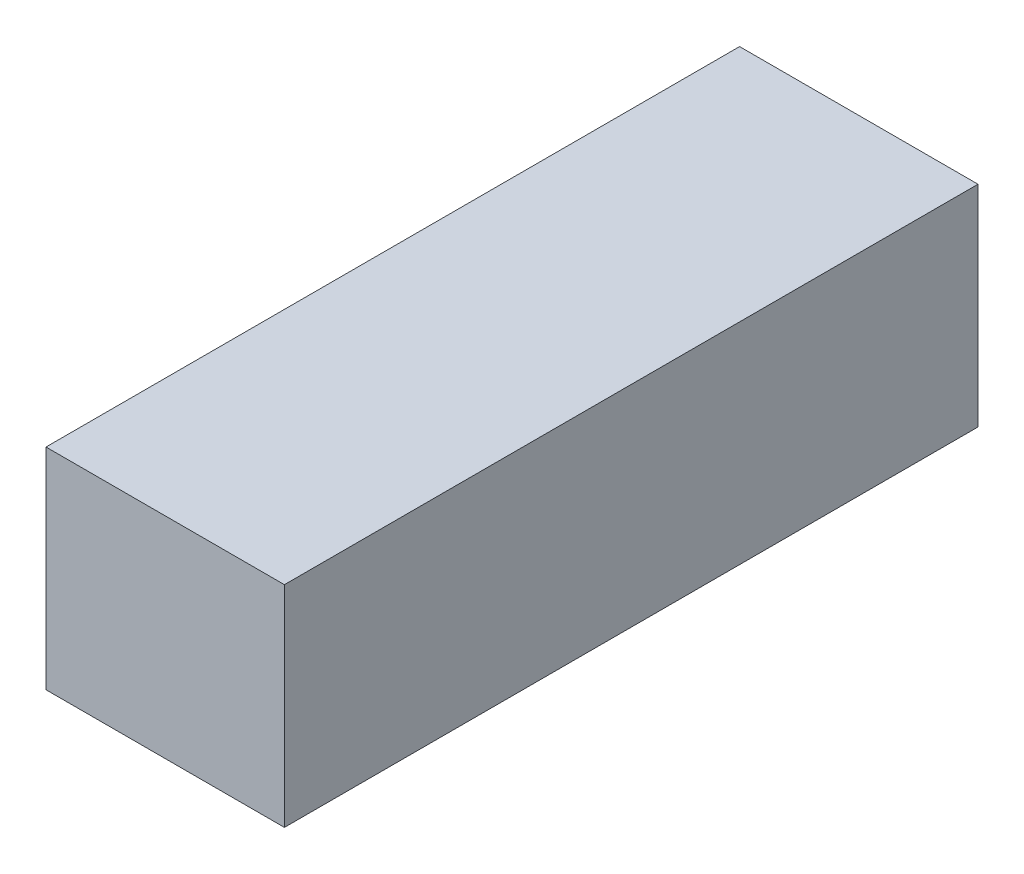
ISO-10303-21;
HEADER;
FILE_DESCRIPTION(('STEP AP214'),'2;1');
FILE_NAME('part.step','',(''),(''),'','','');
FILE_SCHEMA(('AUTOMOTIVE_DESIGN { 1 0 10303 214 1 1 1 1 }'));
ENDSEC;
DATA;
#1=APPLICATION_CONTEXT('core data for automotive mechanical design processes');
#2=APPLICATION_PROTOCOL_DEFINITION('international standard','automotive_design',2000,#1);
#3=PRODUCT_CONTEXT('',#1,'mechanical');
#4=PRODUCT('Part','Part','',(#3));
#5=PRODUCT_RELATED_PRODUCT_CATEGORY('part','',(#4));
#6=PRODUCT_DEFINITION_FORMATION('','',#4);
#7=PRODUCT_DEFINITION_CONTEXT('part definition',#1,'design');
#8=PRODUCT_DEFINITION('design','',#6,#7);
#9=PRODUCT_DEFINITION_SHAPE('','',#8);
#10=(LENGTH_UNIT() NAMED_UNIT(*) SI_UNIT(.MILLI.,.METRE.));
#11=(NAMED_UNIT(*) PLANE_ANGLE_UNIT() SI_UNIT($,.RADIAN.));
#12=(NAMED_UNIT(*) SI_UNIT($,.STERADIAN.) SOLID_ANGLE_UNIT());
#13=UNCERTAINTY_MEASURE_WITH_UNIT(LENGTH_MEASURE(1.E-05),#10,'distance_accuracy_value','');
#14=(GEOMETRIC_REPRESENTATION_CONTEXT(3) GLOBAL_UNCERTAINTY_ASSIGNED_CONTEXT((#13)) GLOBAL_UNIT_ASSIGNED_CONTEXT((#10,
#11,#12)) REPRESENTATION_CONTEXT('',''));
#15=CARTESIAN_POINT('',(0.,0.,0.));
#16=DIRECTION('',(0.,0.,1.));
#17=DIRECTION('',(1.,0.,0.));
#18=AXIS2_PLACEMENT_3D('',#15,#16,#17);
#19=CARTESIAN_POINT('',(0.,0.,160.));
#20=DIRECTION('',(0.,1.,0.));
#21=DIRECTION('',(-1.,0.,0.));
#22=AXIS2_PLACEMENT_3D('',#19,#20,#21);
#23=PLANE('',#22);
#24=DIRECTION('',(1.,0.,0.));
#25=VECTOR('',#24,1.);
#26=CARTESIAN_POINT('',(0.,0.,0.));
#27=LINE('',#26,#25);
#28=CARTESIAN_POINT('',(-55.,0.,0.));
#29=VERTEX_POINT('',#28);
#30=CARTESIAN_POINT('',(0.,0.,0.));
#31=VERTEX_POINT('',#30);
#32=EDGE_CURVE('E106',#29,#31,#27,.T.);
#33=ORIENTED_EDGE('',*,*,#32,.T.);
#34=DIRECTION('',(0.,0.,-1.));
#35=VECTOR('',#34,1.);
#36=CARTESIAN_POINT('',(0.,0.,160.));
#37=LINE('',#36,#35);
#38=CARTESIAN_POINT('',(0.,0.,160.));
#39=VERTEX_POINT('',#38);
#40=EDGE_CURVE('E11',#39,#31,#37,.T.);
#41=ORIENTED_EDGE('',*,*,#40,.F.);
#42=DIRECTION('',(1.,0.,0.));
#43=VECTOR('',#42,1.);
#44=CARTESIAN_POINT('',(0.,0.,160.));
#45=LINE('',#44,#43);
#46=CARTESIAN_POINT('',(-55.,0.,160.));
#47=VERTEX_POINT('',#46);
#48=EDGE_CURVE('E94',#47,#39,#45,.T.);
#49=ORIENTED_EDGE('',*,*,#48,.F.);
#50=DIRECTION('',(0.,0.,-1.));
#51=VECTOR('',#50,1.);
#52=CARTESIAN_POINT('',(-55.,0.,160.));
#53=LINE('',#52,#51);
#54=EDGE_CURVE('E102',#47,#29,#53,.T.);
#55=ORIENTED_EDGE('',*,*,#54,.T.);
#56=EDGE_LOOP('',(#33,#41,#49,#55));
#57=FACE_BOUND('',#56,.T.);
#58=ADVANCED_FACE('F43',(#57),#23,.F.);
#59=CARTESIAN_POINT('',(0.,0.,160.));
#60=DIRECTION('',(-1.,0.,0.));
#61=DIRECTION('',(0.,0.,1.));
#62=AXIS2_PLACEMENT_3D('',#59,#60,#61);
#63=PLANE('',#62);
#64=DIRECTION('',(0.,1.,0.));
#65=VECTOR('',#64,1.);
#66=CARTESIAN_POINT('',(0.,0.,0.));
#67=LINE('',#66,#65);
#68=CARTESIAN_POINT('',(0.,48.5,0.));
#69=VERTEX_POINT('',#68);
#70=EDGE_CURVE('E98',#31,#69,#67,.T.);
#71=ORIENTED_EDGE('',*,*,#70,.T.);
#72=DIRECTION('',(0.,0.,-1.));
#73=VECTOR('',#72,1.);
#74=CARTESIAN_POINT('',(0.,48.5,160.));
#75=LINE('',#74,#73);
#76=CARTESIAN_POINT('',(0.,48.5,160.));
#77=VERTEX_POINT('',#76);
#78=EDGE_CURVE('E51',#77,#69,#75,.T.);
#79=ORIENTED_EDGE('',*,*,#78,.F.);
#80=DIRECTION('',(0.,1.,0.));
#81=VECTOR('',#80,1.);
#82=CARTESIAN_POINT('',(0.,0.,160.));
#83=LINE('',#82,#81);
#84=EDGE_CURVE('E89',#39,#77,#83,.T.);
#85=ORIENTED_EDGE('',*,*,#84,.F.);
#86=ORIENTED_EDGE('',*,*,#40,.T.);
#87=EDGE_LOOP('',(#71,#79,#85,#86));
#88=FACE_BOUND('',#87,.T.);
#89=ADVANCED_FACE('F97',(#88),#63,.F.);
#90=CARTESIAN_POINT('',(0.,48.5,160.));
#91=DIRECTION('',(0.,-1.,0.));
#92=DIRECTION('',(1.,0.,0.));
#93=AXIS2_PLACEMENT_3D('',#90,#91,#92);
#94=PLANE('',#93);
#95=DIRECTION('',(-1.,0.,0.));
#96=VECTOR('',#95,1.);
#97=CARTESIAN_POINT('',(0.,48.5,0.));
#98=LINE('',#97,#96);
#99=CARTESIAN_POINT('',(-55.,48.5,0.));
#100=VERTEX_POINT('',#99);
#101=EDGE_CURVE('E76',#69,#100,#98,.T.);
#102=ORIENTED_EDGE('',*,*,#101,.T.);
#103=DIRECTION('',(0.,0.,-1.));
#104=VECTOR('',#103,1.);
#105=CARTESIAN_POINT('',(-55.,48.5,160.));
#106=LINE('',#105,#104);
#107=CARTESIAN_POINT('',(-55.,48.5,160.));
#108=VERTEX_POINT('',#107);
#109=EDGE_CURVE('E99',#108,#100,#106,.T.);
#110=ORIENTED_EDGE('',*,*,#109,.F.);
#111=DIRECTION('',(-1.,0.,0.));
#112=VECTOR('',#111,1.);
#113=CARTESIAN_POINT('',(0.,48.5,160.));
#114=LINE('',#113,#112);
#115=EDGE_CURVE('E92',#77,#108,#114,.T.);
#116=ORIENTED_EDGE('',*,*,#115,.F.);
#117=ORIENTED_EDGE('',*,*,#78,.T.);
#118=EDGE_LOOP('',(#102,#110,#116,#117));
#119=FACE_BOUND('',#118,.T.);
#120=ADVANCED_FACE('F100',(#119),#94,.F.);
#121=CARTESIAN_POINT('',(-55.,0.,160.));
#122=DIRECTION('',(1.,0.,0.));
#123=DIRECTION('',(0.,0.,-1.));
#124=AXIS2_PLACEMENT_3D('',#121,#122,#123);
#125=PLANE('',#124);
#126=DIRECTION('',(0.,-1.,0.));
#127=VECTOR('',#126,1.);
#128=CARTESIAN_POINT('',(-55.,0.,0.));
#129=LINE('',#128,#127);
#130=EDGE_CURVE('E82',#100,#29,#129,.T.);
#131=ORIENTED_EDGE('',*,*,#130,.T.);
#132=ORIENTED_EDGE('',*,*,#54,.F.);
#133=DIRECTION('',(0.,-1.,0.));
#134=VECTOR('',#133,1.);
#135=CARTESIAN_POINT('',(-55.,0.,160.));
#136=LINE('',#135,#134);
#137=EDGE_CURVE('E59',#108,#47,#136,.T.);
#138=ORIENTED_EDGE('',*,*,#137,.F.);
#139=ORIENTED_EDGE('',*,*,#109,.T.);
#140=EDGE_LOOP('',(#131,#132,#138,#139));
#141=FACE_BOUND('',#140,.T.);
#142=ADVANCED_FACE('F113',(#141),#125,.F.);
#143=CARTESIAN_POINT('',(0.,0.,160.));
#144=DIRECTION('',(0.,0.,-1.));
#145=DIRECTION('',(-1.,0.,0.));
#146=AXIS2_PLACEMENT_3D('',#143,#144,#145);
#147=PLANE('',#146);
#148=ORIENTED_EDGE('',*,*,#48,.T.);
#149=ORIENTED_EDGE('',*,*,#84,.T.);
#150=ORIENTED_EDGE('',*,*,#115,.T.);
#151=ORIENTED_EDGE('',*,*,#137,.T.);
#152=EDGE_LOOP('',(#148,#149,#150,#151));
#153=FACE_BOUND('',#152,.T.);
#154=ADVANCED_FACE('F90',(#153),#147,.F.);
#155=CARTESIAN_POINT('',(0.,0.,0.));
#156=DIRECTION('',(0.,0.,-1.));
#157=DIRECTION('',(-1.,0.,0.));
#158=AXIS2_PLACEMENT_3D('',#155,#156,#157);
#159=PLANE('',#158);
#160=ORIENTED_EDGE('',*,*,#32,.F.);
#161=ORIENTED_EDGE('',*,*,#130,.F.);
#162=ORIENTED_EDGE('',*,*,#101,.F.);
#163=ORIENTED_EDGE('',*,*,#70,.F.);
#164=EDGE_LOOP('',(#160,#161,#162,#163));
#165=FACE_BOUND('',#164,.T.);
#166=ADVANCED_FACE('F116',(#165),#159,.T.);
#167=CLOSED_SHELL('',(#58,#89,#120,#142,#154,#166));
#168=MANIFOLD_SOLID_BREP('B2',#167);
#169=ADVANCED_BREP_SHAPE_REPRESENTATION('',(#18,#168),#14);
#170=SHAPE_DEFINITION_REPRESENTATION(#9,#169);
ENDSEC;
END-ISO-10303-21;
